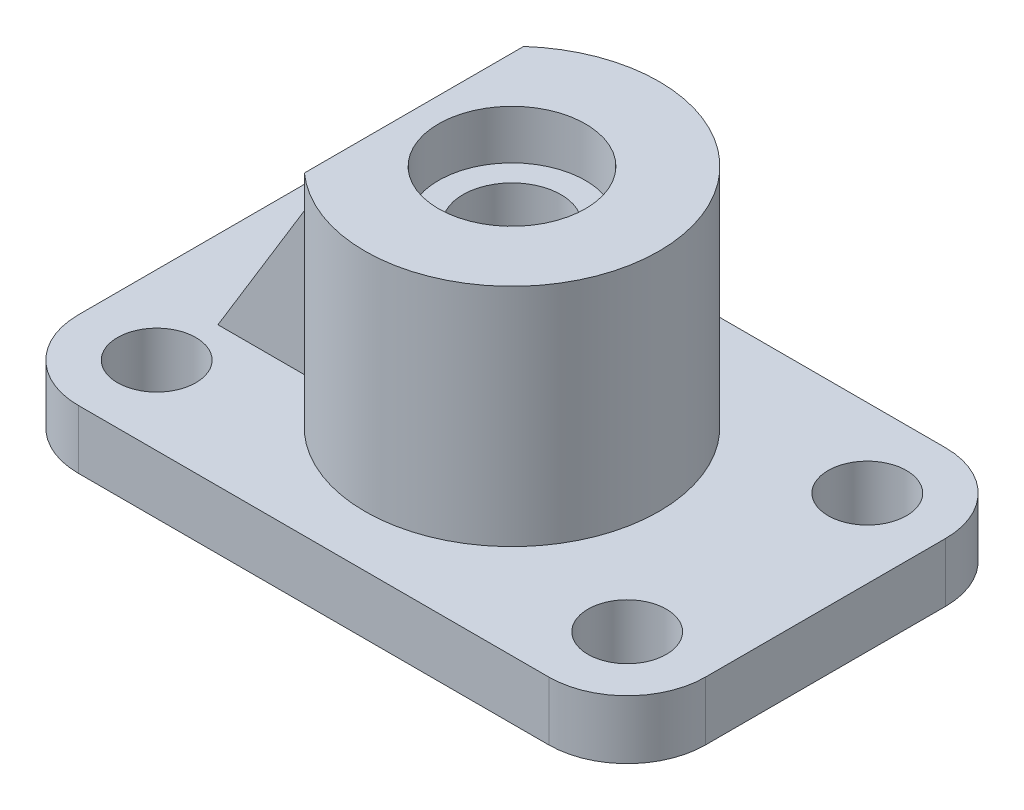
ISO-10303-21;
HEADER;
FILE_DESCRIPTION(('STEP AP214'),'2;1');
FILE_NAME('part.step','',(''),(''),'','','');
FILE_SCHEMA(('AUTOMOTIVE_DESIGN { 1 0 10303 214 1 1 1 1 }'));
ENDSEC;
DATA;
#1=APPLICATION_CONTEXT('core data for automotive mechanical design processes');
#2=APPLICATION_PROTOCOL_DEFINITION('international standard','automotive_design',2000,#1);
#3=PRODUCT_CONTEXT('',#1,'mechanical');
#4=PRODUCT('Part','Part','',(#3));
#5=PRODUCT_RELATED_PRODUCT_CATEGORY('part','',(#4));
#6=PRODUCT_DEFINITION_FORMATION('','',#4);
#7=PRODUCT_DEFINITION_CONTEXT('part definition',#1,'design');
#8=PRODUCT_DEFINITION('design','',#6,#7);
#9=PRODUCT_DEFINITION_SHAPE('','',#8);
#10=(LENGTH_UNIT() NAMED_UNIT(*) SI_UNIT(.MILLI.,.METRE.));
#11=(NAMED_UNIT(*) PLANE_ANGLE_UNIT() SI_UNIT($,.RADIAN.));
#12=(NAMED_UNIT(*) SI_UNIT($,.STERADIAN.) SOLID_ANGLE_UNIT());
#13=UNCERTAINTY_MEASURE_WITH_UNIT(LENGTH_MEASURE(1.E-05),#10,'distance_accuracy_value','');
#14=(GEOMETRIC_REPRESENTATION_CONTEXT(3) GLOBAL_UNCERTAINTY_ASSIGNED_CONTEXT((#13)) GLOBAL_UNIT_ASSIGNED_CONTEXT((#10,
#11,#12)) REPRESENTATION_CONTEXT('',''));
#15=CARTESIAN_POINT('',(0.,0.,0.));
#16=DIRECTION('',(0.,0.,1.));
#17=DIRECTION('',(1.,0.,0.));
#18=AXIS2_PLACEMENT_3D('',#15,#16,#17);
#19=CARTESIAN_POINT('',(-20.,58.,0.));
#20=DIRECTION('',(1.,0.,0.));
#21=DIRECTION('',(0.,0.,-1.));
#22=AXIS2_PLACEMENT_3D('',#19,#20,#21);
#23=PLANE('',#22);
#24=DIRECTION('',(0.,-1.,0.));
#25=VECTOR('',#24,1.);
#26=CARTESIAN_POINT('',(-20.,58.,-36.5));
#27=LINE('',#26,#25);
#28=CARTESIAN_POINT('',(-20.,58.,-36.5));
#29=VERTEX_POINT('',#28);
#30=CARTESIAN_POINT('',(-20.,12.,-36.5));
#31=VERTEX_POINT('',#30);
#32=EDGE_CURVE('E146',#29,#31,#27,.T.);
#33=ORIENTED_EDGE('',*,*,#32,.F.);
#34=DIRECTION('',(0.,0.,1.));
#35=VECTOR('',#34,1.);
#36=CARTESIAN_POINT('',(-20.,58.,0.));
#37=LINE('',#36,#35);
#38=CARTESIAN_POINT('',(-20.,58.,-62.8606797749979));
#39=VERTEX_POINT('',#38);
#40=EDGE_CURVE('E191',#39,#29,#37,.T.);
#41=ORIENTED_EDGE('',*,*,#40,.F.);
#42=DIRECTION('',(0.,-1.,0.));
#43=VECTOR('',#42,1.);
#44=CARTESIAN_POINT('',(-20.,58.,-62.8606797749979));
#45=LINE('',#44,#43);
#46=CARTESIAN_POINT('',(-20.,12.,-62.8606797749979));
#47=VERTEX_POINT('',#46);
#48=EDGE_CURVE('E203',#39,#47,#45,.T.);
#49=ORIENTED_EDGE('',*,*,#48,.T.);
#50=DIRECTION('',(0.,0.,1.));
#51=VECTOR('',#50,1.);
#52=CARTESIAN_POINT('',(-20.,12.,0.));
#53=LINE('',#52,#51);
#54=EDGE_CURVE('E190',#47,#31,#53,.T.);
#55=ORIENTED_EDGE('',*,*,#54,.T.);
#56=EDGE_LOOP('',(#33,#41,#49,#55));
#57=FACE_BOUND('',#56,.T.);
#58=ADVANCED_FACE('F43',(#57),#23,.F.);
#59=CARTESIAN_POINT('',(-48.,12.,-16.));
#60=DIRECTION('',(0.,-1.,0.));
#61=DIRECTION('',(0.,0.,-1.));
#62=AXIS2_PLACEMENT_3D('',#59,#60,#61);
#63=PLANE('',#62);
#64=ORIENTED_EDGE('',*,*,#54,.F.);
#65=CARTESIAN_POINT('',(0.,12.,-40.5));
#66=DIRECTION('',(0.,1.,0.));
#67=DIRECTION('',(0.,0.,1.));
#68=AXIS2_PLACEMENT_3D('',#65,#66,#67);
#69=CIRCLE('',#68,30.);
#70=CARTESIAN_POINT('',(-20.,12.,-18.1393202250021));
#71=VERTEX_POINT('',#70);
#72=EDGE_CURVE('E67',#71,#47,#69,.T.);
#73=ORIENTED_EDGE('',*,*,#72,.F.);
#74=CARTESIAN_POINT('',(-20.,12.,-28.5));
#75=VERTEX_POINT('',#74);
#76=EDGE_CURVE('E198',#75,#71,#53,.T.);
#77=ORIENTED_EDGE('',*,*,#76,.F.);
#78=DIRECTION('',(-1.,0.,0.));
#79=VECTOR('',#78,1.);
#80=CARTESIAN_POINT('',(-48.,12.,-28.5));
#81=LINE('',#80,#79);
#82=CARTESIAN_POINT('',(-48.,12.,-28.5));
#83=VERTEX_POINT('',#82);
#84=EDGE_CURVE('E163',#75,#83,#81,.T.);
#85=ORIENTED_EDGE('',*,*,#84,.T.);
#86=DIRECTION('',(0.,0.,1.));
#87=VECTOR('',#86,1.);
#88=CARTESIAN_POINT('',(-48.,12.,-16.));
#89=LINE('',#88,#87);
#90=CARTESIAN_POINT('',(-48.,12.,-36.5));
#91=VERTEX_POINT('',#90);
#92=EDGE_CURVE('E154',#83,#91,#89,.F.);
#93=ORIENTED_EDGE('',*,*,#92,.T.);
#94=DIRECTION('',(-1.,0.,0.));
#95=VECTOR('',#94,1.);
#96=CARTESIAN_POINT('',(-48.,12.,-36.5));
#97=LINE('',#96,#95);
#98=EDGE_CURVE('E141',#31,#91,#97,.T.);
#99=ORIENTED_EDGE('',*,*,#98,.F.);
#100=EDGE_LOOP('',(#64,#73,#77,#85,#93,#99));
#101=FACE_BOUND('',#100,.T.);
#102=CARTESIAN_POINT('',(48.,12.,-16.));
#103=DIRECTION('',(0.,1.,0.));
#104=DIRECTION('',(0.,0.,1.));
#105=AXIS2_PLACEMENT_3D('',#102,#103,#104);
#106=CIRCLE('',#105,8.);
#107=CARTESIAN_POINT('',(48.,12.,-8.00000000000001));
#108=VERTEX_POINT('',#107);
#109=EDGE_CURVE('E208',#108,#108,#106,.T.);
#110=ORIENTED_EDGE('',*,*,#109,.F.);
#111=EDGE_LOOP('',(#110));
#112=FACE_BOUND('',#111,.T.);
#113=CARTESIAN_POINT('',(48.,12.,-65.));
#114=DIRECTION('',(0.,1.,0.));
#115=DIRECTION('',(0.,0.,1.));
#116=AXIS2_PLACEMENT_3D('',#113,#114,#115);
#117=CIRCLE('',#116,8.);
#118=CARTESIAN_POINT('',(48.,12.,-57.));
#119=VERTEX_POINT('',#118);
#120=EDGE_CURVE('E216',#119,#119,#117,.T.);
#121=ORIENTED_EDGE('',*,*,#120,.F.);
#122=EDGE_LOOP('',(#121));
#123=FACE_BOUND('',#122,.T.);
#124=CARTESIAN_POINT('',(-48.,12.,-65.));
#125=DIRECTION('',(0.,1.,0.));
#126=DIRECTION('',(0.,0.,1.));
#127=AXIS2_PLACEMENT_3D('',#124,#125,#126);
#128=CIRCLE('',#127,8.);
#129=CARTESIAN_POINT('',(-48.,12.,-57.));
#130=VERTEX_POINT('',#129);
#131=EDGE_CURVE('E224',#130,#130,#128,.T.);
#132=ORIENTED_EDGE('',*,*,#131,.F.);
#133=EDGE_LOOP('',(#132));
#134=FACE_BOUND('',#133,.T.);
#135=CARTESIAN_POINT('',(-48.,12.,-16.));
#136=DIRECTION('',(0.,1.,0.));
#137=DIRECTION('',(0.,0.,1.));
#138=AXIS2_PLACEMENT_3D('',#135,#136,#137);
#139=CIRCLE('',#138,8.);
#140=CARTESIAN_POINT('',(-48.,12.,-8.00000000000001));
#141=VERTEX_POINT('',#140);
#142=EDGE_CURVE('E232',#141,#141,#139,.T.);
#143=ORIENTED_EDGE('',*,*,#142,.F.);
#144=EDGE_LOOP('',(#143));
#145=FACE_BOUND('',#144,.T.);
#146=DIRECTION('',(0.,0.,-1.));
#147=VECTOR('',#146,1.);
#148=CARTESIAN_POINT('',(64.,12.,-16.));
#149=LINE('',#148,#147);
#150=CARTESIAN_POINT('',(64.,12.,-16.));
#151=VERTEX_POINT('',#150);
#152=CARTESIAN_POINT('',(64.,12.,-65.));
#153=VERTEX_POINT('',#152);
#154=EDGE_CURVE('E251',#151,#153,#149,.T.);
#155=ORIENTED_EDGE('',*,*,#154,.T.);
#156=CARTESIAN_POINT('',(48.,12.,-65.));
#157=DIRECTION('',(0.,1.,0.));
#158=DIRECTION('',(0.,0.,1.));
#159=AXIS2_PLACEMENT_3D('',#156,#157,#158);
#160=CIRCLE('',#159,16.);
#161=CARTESIAN_POINT('',(48.,12.,-81.));
#162=VERTEX_POINT('',#161);
#163=EDGE_CURVE('E254',#153,#162,#160,.T.);
#164=ORIENTED_EDGE('',*,*,#163,.T.);
#165=DIRECTION('',(-1.,0.,0.));
#166=VECTOR('',#165,1.);
#167=CARTESIAN_POINT('',(-48.,12.,-81.));
#168=LINE('',#167,#166);
#169=CARTESIAN_POINT('',(-48.,12.,-81.));
#170=VERTEX_POINT('',#169);
#171=EDGE_CURVE('E257',#162,#170,#168,.T.);
#172=ORIENTED_EDGE('',*,*,#171,.T.);
#173=CARTESIAN_POINT('',(-48.,12.,-65.));
#174=DIRECTION('',(0.,1.,0.));
#175=DIRECTION('',(0.,0.,-1.));
#176=AXIS2_PLACEMENT_3D('',#173,#174,#175);
#177=CIRCLE('',#176,16.);
#178=CARTESIAN_POINT('',(-64.,12.,-65.));
#179=VERTEX_POINT('',#178);
#180=EDGE_CURVE('E260',#170,#179,#177,.T.);
#181=ORIENTED_EDGE('',*,*,#180,.T.);
#182=DIRECTION('',(0.,0.,1.));
#183=VECTOR('',#182,1.);
#184=CARTESIAN_POINT('',(-64.,12.,-49.));
#185=LINE('',#184,#183);
#186=CARTESIAN_POINT('',(-64.,12.,-16.));
#187=VERTEX_POINT('',#186);
#188=EDGE_CURVE('E263',#179,#187,#185,.T.);
#189=ORIENTED_EDGE('',*,*,#188,.T.);
#190=CARTESIAN_POINT('',(-48.,12.,-16.));
#191=DIRECTION('',(0.,1.,0.));
#192=DIRECTION('',(0.,0.,-1.));
#193=AXIS2_PLACEMENT_3D('',#190,#191,#192);
#194=CIRCLE('',#193,16.);
#195=CARTESIAN_POINT('',(-48.,12.,0.));
#196=VERTEX_POINT('',#195);
#197=EDGE_CURVE('E240',#187,#196,#194,.T.);
#198=ORIENTED_EDGE('',*,*,#197,.T.);
#199=DIRECTION('',(1.,0.,0.));
#200=VECTOR('',#199,1.);
#201=CARTESIAN_POINT('',(48.,12.,0.));
#202=LINE('',#201,#200);
#203=CARTESIAN_POINT('',(48.,12.,0.));
#204=VERTEX_POINT('',#203);
#205=EDGE_CURVE('E244',#196,#204,#202,.T.);
#206=ORIENTED_EDGE('',*,*,#205,.T.);
#207=CARTESIAN_POINT('',(48.,12.,-16.));
#208=DIRECTION('',(0.,1.,0.));
#209=DIRECTION('',(0.,0.,1.));
#210=AXIS2_PLACEMENT_3D('',#207,#208,#209);
#211=CIRCLE('',#210,16.);
#212=EDGE_CURVE('E248',#204,#151,#211,.T.);
#213=ORIENTED_EDGE('',*,*,#212,.T.);
#214=EDGE_LOOP('',(#155,#164,#172,#181,#189,#198,#206,#213));
#215=FACE_BOUND('',#214,.T.);
#216=ADVANCED_FACE('F160',(#101,#112,#123,#134,#145,#215),#63,.F.);
#217=CARTESIAN_POINT('',(-48.,0.,-16.));
#218=DIRECTION('',(0.,-1.,0.));
#219=DIRECTION('',(0.,0.,-1.));
#220=AXIS2_PLACEMENT_3D('',#217,#218,#219);
#221=PLANE('',#220);
#222=CARTESIAN_POINT('',(0.,0.,-40.5));
#223=DIRECTION('',(0.,1.,0.));
#224=DIRECTION('',(0.,0.,1.));
#225=AXIS2_PLACEMENT_3D('',#222,#223,#224);
#226=CIRCLE('',#225,10.);
#227=CARTESIAN_POINT('',(0.,0.,-30.5));
#228=VERTEX_POINT('',#227);
#229=EDGE_CURVE('E170',#228,#228,#226,.T.);
#230=ORIENTED_EDGE('',*,*,#229,.T.);
#231=EDGE_LOOP('',(#230));
#232=FACE_BOUND('',#231,.T.);
#233=CARTESIAN_POINT('',(48.,0.,-65.));
#234=DIRECTION('',(0.,1.,0.));
#235=DIRECTION('',(0.,0.,1.));
#236=AXIS2_PLACEMENT_3D('',#233,#234,#235);
#237=CIRCLE('',#236,16.);
#238=CARTESIAN_POINT('',(64.,0.,-65.));
#239=VERTEX_POINT('',#238);
#240=CARTESIAN_POINT('',(48.,0.,-81.));
#241=VERTEX_POINT('',#240);
#242=EDGE_CURVE('E280',#239,#241,#237,.T.);
#243=ORIENTED_EDGE('',*,*,#242,.F.);
#244=DIRECTION('',(0.,0.,-1.));
#245=VECTOR('',#244,1.);
#246=CARTESIAN_POINT('',(64.,0.,-49.));
#247=LINE('',#246,#245);
#248=CARTESIAN_POINT('',(64.,0.,-16.));
#249=VERTEX_POINT('',#248);
#250=EDGE_CURVE('E277',#249,#239,#247,.T.);
#251=ORIENTED_EDGE('',*,*,#250,.F.);
#252=CARTESIAN_POINT('',(48.,0.,-16.));
#253=DIRECTION('',(0.,1.,0.));
#254=DIRECTION('',(0.,0.,1.));
#255=AXIS2_PLACEMENT_3D('',#252,#253,#254);
#256=CIRCLE('',#255,16.);
#257=CARTESIAN_POINT('',(48.,0.,0.));
#258=VERTEX_POINT('',#257);
#259=EDGE_CURVE('E273',#258,#249,#256,.T.);
#260=ORIENTED_EDGE('',*,*,#259,.F.);
#261=DIRECTION('',(1.,0.,0.));
#262=VECTOR('',#261,1.);
#263=CARTESIAN_POINT('',(48.,0.,0.));
#264=LINE('',#263,#262);
#265=CARTESIAN_POINT('',(-48.,0.,0.));
#266=VERTEX_POINT('',#265);
#267=EDGE_CURVE('E270',#266,#258,#264,.T.);
#268=ORIENTED_EDGE('',*,*,#267,.F.);
#269=CARTESIAN_POINT('',(-48.,0.,-16.));
#270=DIRECTION('',(0.,1.,0.));
#271=DIRECTION('',(0.,0.,-1.));
#272=AXIS2_PLACEMENT_3D('',#269,#270,#271);
#273=CIRCLE('',#272,16.);
#274=CARTESIAN_POINT('',(-64.,0.,-16.));
#275=VERTEX_POINT('',#274);
#276=EDGE_CURVE('E236',#275,#266,#273,.T.);
#277=ORIENTED_EDGE('',*,*,#276,.F.);
#278=DIRECTION('',(0.,0.,1.));
#279=VECTOR('',#278,1.);
#280=CARTESIAN_POINT('',(-64.,0.,-16.));
#281=LINE('',#280,#279);
#282=CARTESIAN_POINT('',(-64.,0.,-65.));
#283=VERTEX_POINT('',#282);
#284=EDGE_CURVE('E245',#283,#275,#281,.T.);
#285=ORIENTED_EDGE('',*,*,#284,.F.);
#286=CARTESIAN_POINT('',(-48.,0.,-65.));
#287=DIRECTION('',(0.,1.,0.));
#288=DIRECTION('',(0.,0.,-1.));
#289=AXIS2_PLACEMENT_3D('',#286,#287,#288);
#290=CIRCLE('',#289,16.);
#291=CARTESIAN_POINT('',(-48.,0.,-81.));
#292=VERTEX_POINT('',#291);
#293=EDGE_CURVE('E286',#292,#283,#290,.T.);
#294=ORIENTED_EDGE('',*,*,#293,.F.);
#295=DIRECTION('',(-1.,0.,0.));
#296=VECTOR('',#295,1.);
#297=CARTESIAN_POINT('',(-48.,0.,-81.));
#298=LINE('',#297,#296);
#299=EDGE_CURVE('E283',#241,#292,#298,.T.);
#300=ORIENTED_EDGE('',*,*,#299,.F.);
#301=EDGE_LOOP('',(#243,#251,#260,#268,#277,#285,#294,#300));
#302=FACE_BOUND('',#301,.T.);
#303=CARTESIAN_POINT('',(48.,0.,-65.));
#304=DIRECTION('',(0.,1.,0.));
#305=DIRECTION('',(0.,0.,1.));
#306=AXIS2_PLACEMENT_3D('',#303,#304,#305);
#307=CIRCLE('',#306,8.);
#308=CARTESIAN_POINT('',(48.,0.,-57.));
#309=VERTEX_POINT('',#308);
#310=EDGE_CURVE('E212',#309,#309,#307,.T.);
#311=ORIENTED_EDGE('',*,*,#310,.T.);
#312=EDGE_LOOP('',(#311));
#313=FACE_BOUND('',#312,.T.);
#314=CARTESIAN_POINT('',(-48.,0.,-16.));
#315=DIRECTION('',(0.,1.,0.));
#316=DIRECTION('',(0.,0.,1.));
#317=AXIS2_PLACEMENT_3D('',#314,#315,#316);
#318=CIRCLE('',#317,8.);
#319=CARTESIAN_POINT('',(-48.,0.,-8.00000000000001));
#320=VERTEX_POINT('',#319);
#321=EDGE_CURVE('E228',#320,#320,#318,.T.);
#322=ORIENTED_EDGE('',*,*,#321,.T.);
#323=EDGE_LOOP('',(#322));
#324=FACE_BOUND('',#323,.T.);
#325=CARTESIAN_POINT('',(-48.,0.,-65.));
#326=DIRECTION('',(0.,1.,0.));
#327=DIRECTION('',(0.,0.,1.));
#328=AXIS2_PLACEMENT_3D('',#325,#326,#327);
#329=CIRCLE('',#328,8.);
#330=CARTESIAN_POINT('',(-48.,0.,-57.));
#331=VERTEX_POINT('',#330);
#332=EDGE_CURVE('E220',#331,#331,#329,.T.);
#333=ORIENTED_EDGE('',*,*,#332,.T.);
#334=EDGE_LOOP('',(#333));
#335=FACE_BOUND('',#334,.T.);
#336=CARTESIAN_POINT('',(48.,0.,-16.));
#337=DIRECTION('',(0.,1.,0.));
#338=DIRECTION('',(0.,0.,1.));
#339=AXIS2_PLACEMENT_3D('',#336,#337,#338);
#340=CIRCLE('',#339,8.);
#341=CARTESIAN_POINT('',(48.,0.,-8.00000000000001));
#342=VERTEX_POINT('',#341);
#343=EDGE_CURVE('E207',#342,#342,#340,.T.);
#344=ORIENTED_EDGE('',*,*,#343,.T.);
#345=EDGE_LOOP('',(#344));
#346=FACE_BOUND('',#345,.T.);
#347=ADVANCED_FACE('F325',(#232,#302,#313,#324,#335,#346),#221,.T.);
#348=CARTESIAN_POINT('',(-48.,12.,-16.));
#349=DIRECTION('',(0.,-1.,0.));
#350=DIRECTION('',(0.,0.,-1.));
#351=AXIS2_PLACEMENT_3D('',#348,#349,#350);
#352=CYLINDRICAL_SURFACE('',#351,16.);
#353=ORIENTED_EDGE('',*,*,#276,.T.);
#354=DIRECTION('',(0.,-1.,0.));
#355=VECTOR('',#354,1.);
#356=CARTESIAN_POINT('',(-48.,12.,0.));
#357=LINE('',#356,#355);
#358=EDGE_CURVE('E11',#196,#266,#357,.T.);
#359=ORIENTED_EDGE('',*,*,#358,.F.);
#360=ORIENTED_EDGE('',*,*,#197,.F.);
#361=DIRECTION('',(0.,-1.,0.));
#362=VECTOR('',#361,1.);
#363=CARTESIAN_POINT('',(-64.,12.,-16.));
#364=LINE('',#363,#362);
#365=EDGE_CURVE('E266',#187,#275,#364,.T.);
#366=ORIENTED_EDGE('',*,*,#365,.T.);
#367=EDGE_LOOP('',(#353,#359,#360,#366));
#368=FACE_BOUND('',#367,.T.);
#369=ADVANCED_FACE('F45',(#368),#352,.T.);
#370=CARTESIAN_POINT('',(48.,12.,0.));
#371=DIRECTION('',(0.,0.,-1.));
#372=DIRECTION('',(-1.,0.,0.));
#373=AXIS2_PLACEMENT_3D('',#370,#371,#372);
#374=PLANE('',#373);
#375=ORIENTED_EDGE('',*,*,#267,.T.);
#376=DIRECTION('',(0.,-1.,0.));
#377=VECTOR('',#376,1.);
#378=CARTESIAN_POINT('',(48.,12.,0.));
#379=LINE('',#378,#377);
#380=EDGE_CURVE('E52',#204,#258,#379,.T.);
#381=ORIENTED_EDGE('',*,*,#380,.F.);
#382=ORIENTED_EDGE('',*,*,#205,.F.);
#383=ORIENTED_EDGE('',*,*,#358,.T.);
#384=EDGE_LOOP('',(#375,#381,#382,#383));
#385=FACE_BOUND('',#384,.T.);
#386=ADVANCED_FACE('F342',(#385),#374,.F.);
#387=CARTESIAN_POINT('',(48.,12.,-16.));
#388=DIRECTION('',(0.,-1.,0.));
#389=DIRECTION('',(0.,0.,-1.));
#390=AXIS2_PLACEMENT_3D('',#387,#388,#389);
#391=CYLINDRICAL_SURFACE('',#390,16.);
#392=ORIENTED_EDGE('',*,*,#259,.T.);
#393=DIRECTION('',(0.,-1.,0.));
#394=VECTOR('',#393,1.);
#395=CARTESIAN_POINT('',(64.,12.,-16.));
#396=LINE('',#395,#394);
#397=EDGE_CURVE('E311',#151,#249,#396,.T.);
#398=ORIENTED_EDGE('',*,*,#397,.F.);
#399=ORIENTED_EDGE('',*,*,#212,.F.);
#400=ORIENTED_EDGE('',*,*,#380,.T.);
#401=EDGE_LOOP('',(#392,#398,#399,#400));
#402=FACE_BOUND('',#401,.T.);
#403=ADVANCED_FACE('F320',(#402),#391,.T.);
#404=CARTESIAN_POINT('',(64.,12.,-49.));
#405=DIRECTION('',(-1.,0.,0.));
#406=DIRECTION('',(0.,0.,1.));
#407=AXIS2_PLACEMENT_3D('',#404,#405,#406);
#408=PLANE('',#407);
#409=ORIENTED_EDGE('',*,*,#250,.T.);
#410=DIRECTION('',(0.,-1.,0.));
#411=VECTOR('',#410,1.);
#412=CARTESIAN_POINT('',(64.,12.,-65.));
#413=LINE('',#412,#411);
#414=EDGE_CURVE('E307',#153,#239,#413,.T.);
#415=ORIENTED_EDGE('',*,*,#414,.F.);
#416=ORIENTED_EDGE('',*,*,#154,.F.);
#417=ORIENTED_EDGE('',*,*,#397,.T.);
#418=EDGE_LOOP('',(#409,#415,#416,#417));
#419=FACE_BOUND('',#418,.T.);
#420=ADVANCED_FACE('F331',(#419),#408,.F.);
#421=CARTESIAN_POINT('',(48.,12.,-65.));
#422=DIRECTION('',(0.,-1.,0.));
#423=DIRECTION('',(0.,0.,-1.));
#424=AXIS2_PLACEMENT_3D('',#421,#422,#423);
#425=CYLINDRICAL_SURFACE('',#424,16.);
#426=ORIENTED_EDGE('',*,*,#242,.T.);
#427=DIRECTION('',(0.,-1.,0.));
#428=VECTOR('',#427,1.);
#429=CARTESIAN_POINT('',(48.,12.,-81.));
#430=LINE('',#429,#428);
#431=EDGE_CURVE('E303',#162,#241,#430,.T.);
#432=ORIENTED_EDGE('',*,*,#431,.F.);
#433=ORIENTED_EDGE('',*,*,#163,.F.);
#434=ORIENTED_EDGE('',*,*,#414,.T.);
#435=EDGE_LOOP('',(#426,#432,#433,#434));
#436=FACE_BOUND('',#435,.T.);
#437=ADVANCED_FACE('F335',(#436),#425,.T.);
#438=CARTESIAN_POINT('',(-48.,12.,-81.));
#439=DIRECTION('',(0.,0.,1.));
#440=DIRECTION('',(1.,0.,0.));
#441=AXIS2_PLACEMENT_3D('',#438,#439,#440);
#442=PLANE('',#441);
#443=ORIENTED_EDGE('',*,*,#299,.T.);
#444=DIRECTION('',(0.,-1.,0.));
#445=VECTOR('',#444,1.);
#446=CARTESIAN_POINT('',(-48.,12.,-81.));
#447=LINE('',#446,#445);
#448=EDGE_CURVE('E299',#170,#292,#447,.T.);
#449=ORIENTED_EDGE('',*,*,#448,.F.);
#450=ORIENTED_EDGE('',*,*,#171,.F.);
#451=ORIENTED_EDGE('',*,*,#431,.T.);
#452=EDGE_LOOP('',(#443,#449,#450,#451));
#453=FACE_BOUND('',#452,.T.);
#454=ADVANCED_FACE('F363',(#453),#442,.F.);
#455=CARTESIAN_POINT('',(-48.,12.,-65.));
#456=DIRECTION('',(0.,-1.,0.));
#457=DIRECTION('',(0.,0.,-1.));
#458=AXIS2_PLACEMENT_3D('',#455,#456,#457);
#459=CYLINDRICAL_SURFACE('',#458,16.);
#460=ORIENTED_EDGE('',*,*,#293,.T.);
#461=DIRECTION('',(0.,-1.,0.));
#462=VECTOR('',#461,1.);
#463=CARTESIAN_POINT('',(-64.,12.,-65.));
#464=LINE('',#463,#462);
#465=EDGE_CURVE('E295',#179,#283,#464,.T.);
#466=ORIENTED_EDGE('',*,*,#465,.F.);
#467=ORIENTED_EDGE('',*,*,#180,.F.);
#468=ORIENTED_EDGE('',*,*,#448,.T.);
#469=EDGE_LOOP('',(#460,#466,#467,#468));
#470=FACE_BOUND('',#469,.T.);
#471=ADVANCED_FACE('F349',(#470),#459,.T.);
#472=CARTESIAN_POINT('',(-64.,12.,-16.));
#473=DIRECTION('',(1.,0.,0.));
#474=DIRECTION('',(0.,0.,-1.));
#475=AXIS2_PLACEMENT_3D('',#472,#473,#474);
#476=PLANE('',#475);
#477=ORIENTED_EDGE('',*,*,#284,.T.);
#478=ORIENTED_EDGE('',*,*,#365,.F.);
#479=ORIENTED_EDGE('',*,*,#188,.F.);
#480=ORIENTED_EDGE('',*,*,#465,.T.);
#481=EDGE_LOOP('',(#477,#478,#479,#480));
#482=FACE_BOUND('',#481,.T.);
#483=ADVANCED_FACE('F352',(#482),#476,.F.);
#484=CARTESIAN_POINT('',(-48.,12.,-16.));
#485=DIRECTION('',(0.,-1.,0.));
#486=DIRECTION('',(0.,0.,-1.));
#487=AXIS2_PLACEMENT_3D('',#484,#485,#486);
#488=CYLINDRICAL_SURFACE('',#487,8.);
#489=ORIENTED_EDGE('',*,*,#142,.T.);
#490=EDGE_LOOP('',(#489));
#491=FACE_BOUND('',#490,.T.);
#492=ORIENTED_EDGE('',*,*,#321,.F.);
#493=EDGE_LOOP('',(#492));
#494=FACE_BOUND('',#493,.T.);
#495=ADVANCED_FACE('F354',(#491,#494),#488,.F.);
#496=CARTESIAN_POINT('',(-48.,12.,-65.));
#497=DIRECTION('',(0.,-1.,0.));
#498=DIRECTION('',(0.,0.,-1.));
#499=AXIS2_PLACEMENT_3D('',#496,#497,#498);
#500=CYLINDRICAL_SURFACE('',#499,8.);
#501=ORIENTED_EDGE('',*,*,#131,.T.);
#502=EDGE_LOOP('',(#501));
#503=FACE_BOUND('',#502,.T.);
#504=ORIENTED_EDGE('',*,*,#332,.F.);
#505=EDGE_LOOP('',(#504));
#506=FACE_BOUND('',#505,.T.);
#507=ADVANCED_FACE('F360',(#503,#506),#500,.F.);
#508=CARTESIAN_POINT('',(48.,12.,-65.));
#509=DIRECTION('',(0.,-1.,0.));
#510=DIRECTION('',(0.,0.,-1.));
#511=AXIS2_PLACEMENT_3D('',#508,#509,#510);
#512=CYLINDRICAL_SURFACE('',#511,8.);
#513=ORIENTED_EDGE('',*,*,#120,.T.);
#514=EDGE_LOOP('',(#513));
#515=FACE_BOUND('',#514,.T.);
#516=ORIENTED_EDGE('',*,*,#310,.F.);
#517=EDGE_LOOP('',(#516));
#518=FACE_BOUND('',#517,.T.);
#519=ADVANCED_FACE('F514',(#515,#518),#512,.F.);
#520=CARTESIAN_POINT('',(48.,12.,-16.));
#521=DIRECTION('',(0.,-1.,0.));
#522=DIRECTION('',(0.,0.,-1.));
#523=AXIS2_PLACEMENT_3D('',#520,#521,#522);
#524=CYLINDRICAL_SURFACE('',#523,8.);
#525=ORIENTED_EDGE('',*,*,#109,.T.);
#526=EDGE_LOOP('',(#525));
#527=FACE_BOUND('',#526,.T.);
#528=ORIENTED_EDGE('',*,*,#343,.F.);
#529=EDGE_LOOP('',(#528));
#530=FACE_BOUND('',#529,.T.);
#531=ADVANCED_FACE('F386',(#527,#530),#524,.F.);
#532=CARTESIAN_POINT('',(0.,58.,-40.5));
#533=DIRECTION('',(0.,-1.,0.));
#534=DIRECTION('',(0.,0.,-1.));
#535=AXIS2_PLACEMENT_3D('',#532,#533,#534);
#536=CYLINDRICAL_SURFACE('',#535,30.);
#537=ORIENTED_EDGE('',*,*,#72,.T.);
#538=ORIENTED_EDGE('',*,*,#48,.F.);
#539=CARTESIAN_POINT('',(0.,58.,-40.5));
#540=DIRECTION('',(0.,1.,0.));
#541=DIRECTION('',(0.,0.,1.));
#542=AXIS2_PLACEMENT_3D('',#539,#540,#541);
#543=CIRCLE('',#542,30.);
#544=CARTESIAN_POINT('',(-20.,58.,-18.1393202250021));
#545=VERTEX_POINT('',#544);
#546=EDGE_CURVE('E186',#545,#39,#543,.T.);
#547=ORIENTED_EDGE('',*,*,#546,.F.);
#548=DIRECTION('',(0.,-1.,0.));
#549=VECTOR('',#548,1.);
#550=CARTESIAN_POINT('',(-20.,58.,-18.1393202250021));
#551=LINE('',#550,#549);
#552=EDGE_CURVE('E195',#545,#71,#551,.T.);
#553=ORIENTED_EDGE('',*,*,#552,.T.);
#554=EDGE_LOOP('',(#537,#538,#547,#553));
#555=FACE_BOUND('',#554,.T.);
#556=ADVANCED_FACE('F378',(#555),#536,.T.);
#557=CARTESIAN_POINT('',(-20.,58.,-28.5));
#558=VERTEX_POINT('',#557);
#559=EDGE_CURVE('E189',#558,#545,#37,.T.);
#560=ORIENTED_EDGE('',*,*,#559,.F.);
#561=DIRECTION('',(0.,-1.,0.));
#562=VECTOR('',#561,1.);
#563=CARTESIAN_POINT('',(-20.,58.,-28.5));
#564=LINE('',#563,#562);
#565=EDGE_CURVE('E151',#558,#75,#564,.T.);
#566=ORIENTED_EDGE('',*,*,#565,.T.);
#567=ORIENTED_EDGE('',*,*,#76,.T.);
#568=ORIENTED_EDGE('',*,*,#552,.F.);
#569=EDGE_LOOP('',(#560,#566,#567,#568));
#570=FACE_BOUND('',#569,.T.);
#571=ADVANCED_FACE('F369',(#570),#23,.F.);
#572=CARTESIAN_POINT('',(0.,58.,0.));
#573=DIRECTION('',(0.,1.,0.));
#574=DIRECTION('',(0.,0.,1.));
#575=AXIS2_PLACEMENT_3D('',#572,#573,#574);
#576=PLANE('',#575);
#577=CARTESIAN_POINT('',(0.,58.,-40.5));
#578=DIRECTION('',(0.,1.,0.));
#579=DIRECTION('',(0.,0.,1.));
#580=AXIS2_PLACEMENT_3D('',#577,#578,#579);
#581=CIRCLE('',#580,15.);
#582=CARTESIAN_POINT('',(0.,58.,-25.5));
#583=VERTEX_POINT('',#582);
#584=EDGE_CURVE('E177',#583,#583,#581,.T.);
#585=ORIENTED_EDGE('',*,*,#584,.F.);
#586=EDGE_LOOP('',(#585));
#587=FACE_BOUND('',#586,.T.);
#588=EDGE_CURVE('E156',#29,#558,#37,.T.);
#589=ORIENTED_EDGE('',*,*,#588,.T.);
#590=ORIENTED_EDGE('',*,*,#559,.T.);
#591=ORIENTED_EDGE('',*,*,#546,.T.);
#592=ORIENTED_EDGE('',*,*,#40,.T.);
#593=EDGE_LOOP('',(#589,#590,#591,#592));
#594=FACE_BOUND('',#593,.T.);
#595=ADVANCED_FACE('F377',(#587,#594),#576,.T.);
#596=CARTESIAN_POINT('',(0.,48.,-40.5));
#597=DIRECTION('',(0.,1.,0.));
#598=DIRECTION('',(0.,0.,1.));
#599=AXIS2_PLACEMENT_3D('',#596,#597,#598);
#600=CYLINDRICAL_SURFACE('',#599,15.);
#601=CARTESIAN_POINT('',(0.,48.,-40.5));
#602=DIRECTION('',(0.,1.,0.));
#603=DIRECTION('',(0.,0.,1.));
#604=AXIS2_PLACEMENT_3D('',#601,#602,#603);
#605=CIRCLE('',#604,15.);
#606=CARTESIAN_POINT('',(0.,48.,-25.5));
#607=VERTEX_POINT('',#606);
#608=EDGE_CURVE('E179',#607,#607,#605,.T.);
#609=ORIENTED_EDGE('',*,*,#608,.F.);
#610=EDGE_LOOP('',(#609));
#611=FACE_BOUND('',#610,.T.);
#612=ORIENTED_EDGE('',*,*,#584,.T.);
#613=EDGE_LOOP('',(#612));
#614=FACE_BOUND('',#613,.T.);
#615=ADVANCED_FACE('F384',(#611,#614),#600,.F.);
#616=CARTESIAN_POINT('',(0.,48.,-40.5));
#617=DIRECTION('',(0.,1.,0.));
#618=DIRECTION('',(0.,0.,1.));
#619=AXIS2_PLACEMENT_3D('',#616,#617,#618);
#620=PLANE('',#619);
#621=ORIENTED_EDGE('',*,*,#608,.T.);
#622=EDGE_LOOP('',(#621));
#623=FACE_BOUND('',#622,.T.);
#624=CARTESIAN_POINT('',(0.,48.,-40.5));
#625=DIRECTION('',(0.,1.,0.));
#626=DIRECTION('',(0.,0.,1.));
#627=AXIS2_PLACEMENT_3D('',#624,#625,#626);
#628=CIRCLE('',#627,10.);
#629=CARTESIAN_POINT('',(0.,48.,-30.5));
#630=VERTEX_POINT('',#629);
#631=EDGE_CURVE('E165',#630,#630,#628,.T.);
#632=ORIENTED_EDGE('',*,*,#631,.F.);
#633=EDGE_LOOP('',(#632));
#634=FACE_BOUND('',#633,.T.);
#635=ADVANCED_FACE('F415',(#623,#634),#620,.T.);
#636=CARTESIAN_POINT('',(0.,0.,-40.5));
#637=DIRECTION('',(0.,1.,0.));
#638=DIRECTION('',(0.,0.,1.));
#639=AXIS2_PLACEMENT_3D('',#636,#637,#638);
#640=CYLINDRICAL_SURFACE('',#639,10.);
#641=ORIENTED_EDGE('',*,*,#229,.F.);
#642=EDGE_LOOP('',(#641));
#643=FACE_BOUND('',#642,.T.);
#644=ORIENTED_EDGE('',*,*,#631,.T.);
#645=EDGE_LOOP('',(#644));
#646=FACE_BOUND('',#645,.T.);
#647=ADVANCED_FACE('F410',(#643,#646),#640,.F.);
#648=CARTESIAN_POINT('',(-48.,12.,-32.5));
#649=DIRECTION('',(0.854198555614439,-0.519946946895745,0.));
#650=DIRECTION('',(0.519946946895745,0.854198555614438,0.));
#651=AXIS2_PLACEMENT_3D('',#648,#649,#650);
#652=PLANE('',#651);
#653=ORIENTED_EDGE('',*,*,#92,.F.);
#654=DIRECTION('',(0.519946946895745,0.854198555614438,0.));
#655=VECTOR('',#654,1.);
#656=CARTESIAN_POINT('',(-48.,12.,-28.5));
#657=LINE('',#656,#655);
#658=EDGE_CURVE('E59',#83,#558,#657,.T.);
#659=ORIENTED_EDGE('',*,*,#658,.T.);
#660=ORIENTED_EDGE('',*,*,#588,.F.);
#661=DIRECTION('',(0.519946946895745,0.854198555614438,0.));
#662=VECTOR('',#661,1.);
#663=CARTESIAN_POINT('',(-48.,12.,-36.5));
#664=LINE('',#663,#662);
#665=EDGE_CURVE('E144',#91,#29,#664,.T.);
#666=ORIENTED_EDGE('',*,*,#665,.F.);
#667=EDGE_LOOP('',(#653,#659,#660,#666));
#668=FACE_BOUND('',#667,.T.);
#669=ADVANCED_FACE('F153',(#668),#652,.F.);
#670=CARTESIAN_POINT('',(0.,29.,-28.5));
#671=DIRECTION('',(0.,0.,1.));
#672=DIRECTION('',(1.,0.,0.));
#673=AXIS2_PLACEMENT_3D('',#670,#671,#672);
#674=PLANE('',#673);
#675=ORIENTED_EDGE('',*,*,#84,.F.);
#676=ORIENTED_EDGE('',*,*,#565,.F.);
#677=ORIENTED_EDGE('',*,*,#658,.F.);
#678=EDGE_LOOP('',(#675,#676,#677));
#679=FACE_BOUND('',#678,.T.);
#680=ADVANCED_FACE('F402',(#679),#674,.T.);
#681=CARTESIAN_POINT('',(0.,29.,-36.5));
#682=DIRECTION('',(0.,0.,1.));
#683=DIRECTION('',(1.,0.,0.));
#684=AXIS2_PLACEMENT_3D('',#681,#682,#683);
#685=PLANE('',#684);
#686=ORIENTED_EDGE('',*,*,#32,.T.);
#687=ORIENTED_EDGE('',*,*,#98,.T.);
#688=ORIENTED_EDGE('',*,*,#665,.T.);
#689=EDGE_LOOP('',(#686,#687,#688));
#690=FACE_BOUND('',#689,.T.);
#691=ADVANCED_FACE('F143',(#690),#685,.F.);
#692=CLOSED_SHELL('',(#58,#216,#347,#369,#386,#403,#420,#437,#454,#471,#483,#495,#507,#519,#531,
#556,#571,#595,#615,#635,#647,#669,#680,#691));
#693=MANIFOLD_SOLID_BREP('B2',#692);
#694=ADVANCED_BREP_SHAPE_REPRESENTATION('',(#18,#693),#14);
#695=SHAPE_DEFINITION_REPRESENTATION(#9,#694);
ENDSEC;
END-ISO-10303-21;
